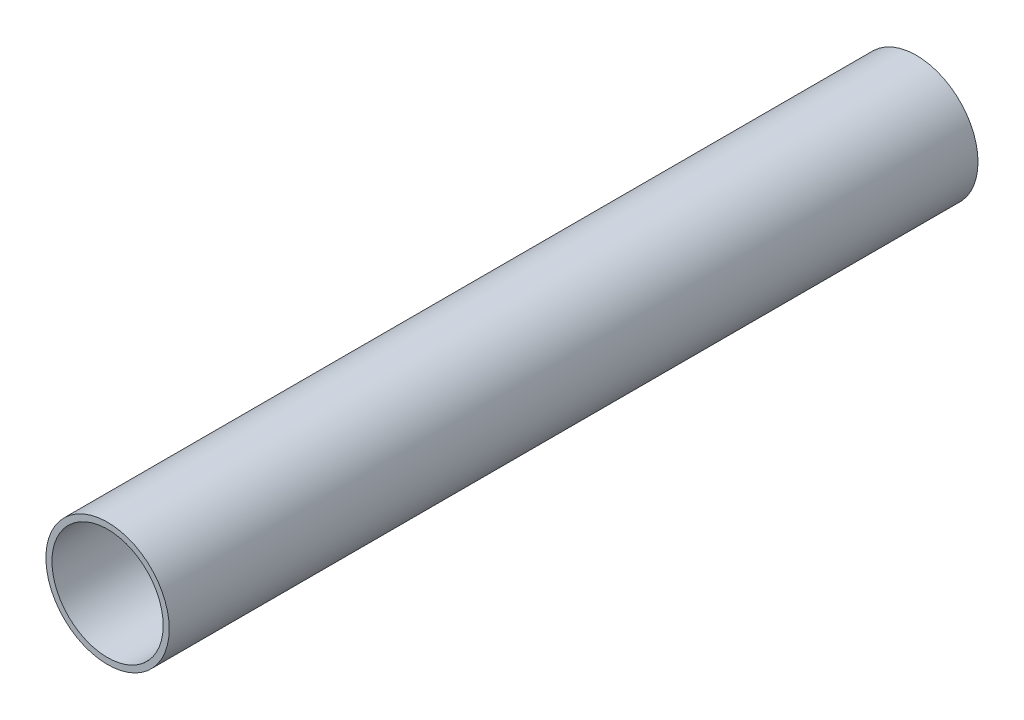
ISO-10303-21;
HEADER;
FILE_DESCRIPTION(('STEP AP214'),'2;1');
FILE_NAME('part.step','',(''),(''),'','','');
FILE_SCHEMA(('AUTOMOTIVE_DESIGN { 1 0 10303 214 1 1 1 1 }'));
ENDSEC;
DATA;
#1=APPLICATION_CONTEXT('core data for automotive mechanical design processes');
#2=APPLICATION_PROTOCOL_DEFINITION('international standard','automotive_design',2000,#1);
#3=PRODUCT_CONTEXT('',#1,'mechanical');
#4=PRODUCT('Part','Part','',(#3));
#5=PRODUCT_RELATED_PRODUCT_CATEGORY('part','',(#4));
#6=PRODUCT_DEFINITION_FORMATION('','',#4);
#7=PRODUCT_DEFINITION_CONTEXT('part definition',#1,'design');
#8=PRODUCT_DEFINITION('design','',#6,#7);
#9=PRODUCT_DEFINITION_SHAPE('','',#8);
#10=(LENGTH_UNIT() NAMED_UNIT(*) SI_UNIT(.MILLI.,.METRE.));
#11=(NAMED_UNIT(*) PLANE_ANGLE_UNIT() SI_UNIT($,.RADIAN.));
#12=(NAMED_UNIT(*) SI_UNIT($,.STERADIAN.) SOLID_ANGLE_UNIT());
#13=UNCERTAINTY_MEASURE_WITH_UNIT(LENGTH_MEASURE(1.E-05),#10,'distance_accuracy_value','');
#14=(GEOMETRIC_REPRESENTATION_CONTEXT(3) GLOBAL_UNCERTAINTY_ASSIGNED_CONTEXT((#13)) GLOBAL_UNIT_ASSIGNED_CONTEXT((#10,
#11,#12)) REPRESENTATION_CONTEXT('',''));
#15=CARTESIAN_POINT('',(0.,0.,0.));
#16=DIRECTION('',(0.,0.,1.));
#17=DIRECTION('',(1.,0.,0.));
#18=AXIS2_PLACEMENT_3D('',#15,#16,#17);
#19=CARTESIAN_POINT('',(0.,0.,101.6));
#20=DIRECTION('',(0.,0.,1.));
#21=DIRECTION('',(1.,0.,0.));
#22=AXIS2_PLACEMENT_3D('',#19,#20,#21);
#23=PLANE('',#22);
#24=CARTESIAN_POINT('',(0.,0.,101.6));
#25=DIRECTION('',(0.,0.,1.));
#26=DIRECTION('',(1.,0.,0.));
#27=AXIS2_PLACEMENT_3D('',#24,#25,#26);
#28=CIRCLE('',#27,7.747);
#29=CARTESIAN_POINT('',(7.747,0.,101.6));
#30=VERTEX_POINT('',#29);
#31=EDGE_CURVE('E10',#30,#30,#28,.T.);
#32=ORIENTED_EDGE('',*,*,#31,.T.);
#33=EDGE_LOOP('',(#32));
#34=FACE_BOUND('',#33,.T.);
#35=CARTESIAN_POINT('',(0.,0.,101.6));
#36=DIRECTION('',(0.,0.,1.));
#37=DIRECTION('',(1.,0.,0.));
#38=AXIS2_PLACEMENT_3D('',#35,#36,#37);
#39=CIRCLE('',#38,6.985);
#40=CARTESIAN_POINT('',(6.985,0.,101.6));
#41=VERTEX_POINT('',#40);
#42=EDGE_CURVE('E50',#41,#41,#39,.T.);
#43=ORIENTED_EDGE('',*,*,#42,.F.);
#44=EDGE_LOOP('',(#43));
#45=FACE_BOUND('',#44,.T.);
#46=ADVANCED_FACE('F37',(#34,#45),#23,.T.);
#47=CARTESIAN_POINT('',(0.,0.,0.));
#48=DIRECTION('',(0.,0.,1.));
#49=DIRECTION('',(1.,0.,0.));
#50=AXIS2_PLACEMENT_3D('',#47,#48,#49);
#51=PLANE('',#50);
#52=CARTESIAN_POINT('',(0.,0.,0.));
#53=DIRECTION('',(0.,0.,1.));
#54=DIRECTION('',(1.,0.,0.));
#55=AXIS2_PLACEMENT_3D('',#52,#53,#54);
#56=CIRCLE('',#55,7.747);
#57=CARTESIAN_POINT('',(7.747,0.,0.));
#58=VERTEX_POINT('',#57);
#59=EDGE_CURVE('E41',#58,#58,#56,.T.);
#60=ORIENTED_EDGE('',*,*,#59,.F.);
#61=EDGE_LOOP('',(#60));
#62=FACE_BOUND('',#61,.T.);
#63=CARTESIAN_POINT('',(0.,0.,0.));
#64=DIRECTION('',(0.,0.,1.));
#65=DIRECTION('',(1.,0.,0.));
#66=AXIS2_PLACEMENT_3D('',#63,#64,#65);
#67=CIRCLE('',#66,6.985);
#68=CARTESIAN_POINT('',(6.985,0.,0.));
#69=VERTEX_POINT('',#68);
#70=EDGE_CURVE('E52',#69,#69,#67,.T.);
#71=ORIENTED_EDGE('',*,*,#70,.T.);
#72=EDGE_LOOP('',(#71));
#73=FACE_BOUND('',#72,.T.);
#74=ADVANCED_FACE('F64',(#62,#73),#51,.F.);
#75=CARTESIAN_POINT('',(0.,0.,101.6));
#76=DIRECTION('',(0.,0.,-1.));
#77=DIRECTION('',(-1.,0.,0.));
#78=AXIS2_PLACEMENT_3D('',#75,#76,#77);
#79=CYLINDRICAL_SURFACE('',#78,7.747);
#80=ORIENTED_EDGE('',*,*,#31,.F.);
#81=EDGE_LOOP('',(#80));
#82=FACE_BOUND('',#81,.T.);
#83=ORIENTED_EDGE('',*,*,#59,.T.);
#84=EDGE_LOOP('',(#83));
#85=FACE_BOUND('',#84,.T.);
#86=ADVANCED_FACE('F39',(#82,#85),#79,.T.);
#87=CARTESIAN_POINT('',(0.,0.,101.6));
#88=DIRECTION('',(0.,0.,-1.));
#89=DIRECTION('',(-1.,0.,0.));
#90=AXIS2_PLACEMENT_3D('',#87,#88,#89);
#91=CYLINDRICAL_SURFACE('',#90,6.985);
#92=ORIENTED_EDGE('',*,*,#42,.T.);
#93=EDGE_LOOP('',(#92));
#94=FACE_BOUND('',#93,.T.);
#95=ORIENTED_EDGE('',*,*,#70,.F.);
#96=EDGE_LOOP('',(#95));
#97=FACE_BOUND('',#96,.T.);
#98=ADVANCED_FACE('F60',(#94,#97),#91,.F.);
#99=CLOSED_SHELL('',(#46,#74,#86,#98));
#100=MANIFOLD_SOLID_BREP('B2',#99);
#101=ADVANCED_BREP_SHAPE_REPRESENTATION('',(#18,#100),#14);
#102=SHAPE_DEFINITION_REPRESENTATION(#9,#101);
ENDSEC;
END-ISO-10303-21;
